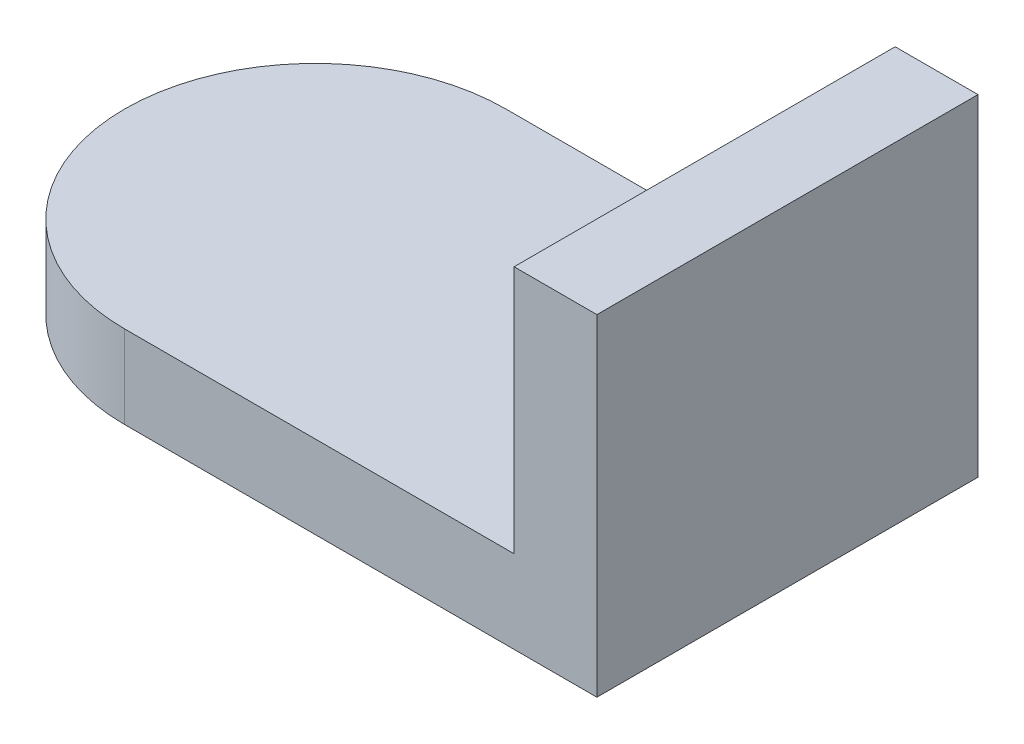
ISO-10303-21;
HEADER;
FILE_DESCRIPTION(('STEP AP214'),'2;1');
FILE_NAME('part.step','',(''),(''),'','','');
FILE_SCHEMA(('AUTOMOTIVE_DESIGN { 1 0 10303 214 1 1 1 1 }'));
ENDSEC;
DATA;
#1=APPLICATION_CONTEXT('core data for automotive mechanical design processes');
#2=APPLICATION_PROTOCOL_DEFINITION('international standard','automotive_design',2000,#1);
#3=PRODUCT_CONTEXT('',#1,'mechanical');
#4=PRODUCT('Part','Part','',(#3));
#5=PRODUCT_RELATED_PRODUCT_CATEGORY('part','',(#4));
#6=PRODUCT_DEFINITION_FORMATION('','',#4);
#7=PRODUCT_DEFINITION_CONTEXT('part definition',#1,'design');
#8=PRODUCT_DEFINITION('design','',#6,#7);
#9=PRODUCT_DEFINITION_SHAPE('','',#8);
#10=(LENGTH_UNIT() NAMED_UNIT(*) SI_UNIT(.MILLI.,.METRE.));
#11=(NAMED_UNIT(*) PLANE_ANGLE_UNIT() SI_UNIT($,.RADIAN.));
#12=(NAMED_UNIT(*) SI_UNIT($,.STERADIAN.) SOLID_ANGLE_UNIT());
#13=UNCERTAINTY_MEASURE_WITH_UNIT(LENGTH_MEASURE(1.E-05),#10,'distance_accuracy_value','');
#14=(GEOMETRIC_REPRESENTATION_CONTEXT(3) GLOBAL_UNCERTAINTY_ASSIGNED_CONTEXT((#13)) GLOBAL_UNIT_ASSIGNED_CONTEXT((#10,
#11,#12)) REPRESENTATION_CONTEXT('',''));
#15=CARTESIAN_POINT('',(0.,0.,0.));
#16=DIRECTION('',(0.,0.,1.));
#17=DIRECTION('',(1.,0.,0.));
#18=AXIS2_PLACEMENT_3D('',#15,#16,#17);
#19=CARTESIAN_POINT('',(1.45,-0.2,0.135));
#20=DIRECTION('',(0.,0.,-1.));
#21=DIRECTION('',(1.,0.,0.));
#22=AXIS2_PLACEMENT_3D('',#19,#20,#21);
#23=PLANE('',#22);
#24=DIRECTION('',(0.,-1.,0.));
#25=VECTOR('',#24,1.);
#26=CARTESIAN_POINT('',(1.5,-0.2,0.135));
#27=LINE('',#26,#25);
#28=CARTESIAN_POINT('',(1.5,-0.2,0.135));
#29=VERTEX_POINT('',#28);
#30=CARTESIAN_POINT('',(1.5,-0.4,0.135));
#31=VERTEX_POINT('',#30);
#32=EDGE_CURVE('E11',#29,#31,#27,.T.);
#33=ORIENTED_EDGE('',*,*,#32,.T.);
#34=DIRECTION('',(1.,0.,0.));
#35=VECTOR('',#34,1.);
#36=CARTESIAN_POINT('',(1.45,-0.4,0.135));
#37=LINE('',#36,#35);
#38=CARTESIAN_POINT('',(1.215,-0.4,0.135));
#39=VERTEX_POINT('',#38);
#40=EDGE_CURVE('E24',#39,#31,#37,.T.);
#41=ORIENTED_EDGE('',*,*,#40,.F.);
#42=DIRECTION('',(0.,-1.,0.));
#43=VECTOR('',#42,1.);
#44=CARTESIAN_POINT('',(1.215,-0.35,0.135));
#45=LINE('',#44,#43);
#46=CARTESIAN_POINT('',(1.215,-0.35,0.135));
#47=VERTEX_POINT('',#46);
#48=EDGE_CURVE('E86',#47,#39,#45,.T.);
#49=ORIENTED_EDGE('',*,*,#48,.F.);
#50=DIRECTION('',(-1.,0.,0.));
#51=VECTOR('',#50,1.);
#52=CARTESIAN_POINT('',(1.45,-0.35,0.135));
#53=LINE('',#52,#51);
#54=CARTESIAN_POINT('',(1.45,-0.35,0.135));
#55=VERTEX_POINT('',#54);
#56=EDGE_CURVE('E115',#55,#47,#53,.T.);
#57=ORIENTED_EDGE('',*,*,#56,.F.);
#58=DIRECTION('',(0.,-1.,0.));
#59=VECTOR('',#58,1.);
#60=CARTESIAN_POINT('',(1.45,-0.2,0.135));
#61=LINE('',#60,#59);
#62=CARTESIAN_POINT('',(1.45,-0.2,0.135));
#63=VERTEX_POINT('',#62);
#64=EDGE_CURVE('E112',#63,#55,#61,.T.);
#65=ORIENTED_EDGE('',*,*,#64,.F.);
#66=DIRECTION('',(1.,0.,0.));
#67=VECTOR('',#66,1.);
#68=CARTESIAN_POINT('',(1.45,-0.2,0.135));
#69=LINE('',#68,#67);
#70=EDGE_CURVE('E110',#63,#29,#69,.T.);
#71=ORIENTED_EDGE('',*,*,#70,.T.);
#72=EDGE_LOOP('',(#33,#41,#49,#57,#65,#71));
#73=FACE_BOUND('',#72,.T.);
#74=ADVANCED_FACE('F17',(#73),#23,.T.);
#75=CARTESIAN_POINT('',(1.45,-0.2,0.135));
#76=DIRECTION('',(0.,1.,0.));
#77=DIRECTION('',(0.,0.,1.));
#78=AXIS2_PLACEMENT_3D('',#75,#76,#77);
#79=PLANE('',#78);
#80=DIRECTION('',(0.,0.,-1.));
#81=VECTOR('',#80,1.);
#82=CARTESIAN_POINT('',(1.5,-0.2,0.135));
#83=LINE('',#82,#81);
#84=CARTESIAN_POINT('',(1.5,-0.2,0.365));
#85=VERTEX_POINT('',#84);
#86=EDGE_CURVE('E107',#85,#29,#83,.T.);
#87=ORIENTED_EDGE('',*,*,#86,.T.);
#88=ORIENTED_EDGE('',*,*,#70,.F.);
#89=DIRECTION('',(0.,0.,-1.));
#90=VECTOR('',#89,1.);
#91=CARTESIAN_POINT('',(1.45,-0.2,0.135));
#92=LINE('',#91,#90);
#93=CARTESIAN_POINT('',(1.45,-0.2,0.365));
#94=VERTEX_POINT('',#93);
#95=EDGE_CURVE('E104',#94,#63,#92,.T.);
#96=ORIENTED_EDGE('',*,*,#95,.F.);
#97=DIRECTION('',(1.,0.,0.));
#98=VECTOR('',#97,1.);
#99=CARTESIAN_POINT('',(1.45,-0.2,0.365));
#100=LINE('',#99,#98);
#101=EDGE_CURVE('E101',#94,#85,#100,.T.);
#102=ORIENTED_EDGE('',*,*,#101,.T.);
#103=EDGE_LOOP('',(#87,#88,#96,#102));
#104=FACE_BOUND('',#103,.T.);
#105=ADVANCED_FACE('F127',(#104),#79,.T.);
#106=CARTESIAN_POINT('',(1.45,-0.2,0.365));
#107=DIRECTION('',(0.,0.,1.));
#108=DIRECTION('',(0.,-1.,0.));
#109=AXIS2_PLACEMENT_3D('',#106,#107,#108);
#110=PLANE('',#109);
#111=DIRECTION('',(0.,1.,0.));
#112=VECTOR('',#111,1.);
#113=CARTESIAN_POINT('',(1.5,-0.2,0.365));
#114=LINE('',#113,#112);
#115=CARTESIAN_POINT('',(1.5,-0.4,0.365000000000001));
#116=VERTEX_POINT('',#115);
#117=EDGE_CURVE('E99',#116,#85,#114,.T.);
#118=ORIENTED_EDGE('',*,*,#117,.T.);
#119=ORIENTED_EDGE('',*,*,#101,.F.);
#120=DIRECTION('',(0.,1.,0.));
#121=VECTOR('',#120,1.);
#122=CARTESIAN_POINT('',(1.45,-0.2,0.365));
#123=LINE('',#122,#121);
#124=CARTESIAN_POINT('',(1.45,-0.35,0.365000000000001));
#125=VERTEX_POINT('',#124);
#126=EDGE_CURVE('E96',#125,#94,#123,.T.);
#127=ORIENTED_EDGE('',*,*,#126,.F.);
#128=DIRECTION('',(1.,0.,0.));
#129=VECTOR('',#128,1.);
#130=CARTESIAN_POINT('',(1.45,-0.35,0.365000000000001));
#131=LINE('',#130,#129);
#132=CARTESIAN_POINT('',(1.215,-0.35,0.365000000000001));
#133=VERTEX_POINT('',#132);
#134=EDGE_CURVE('E72',#133,#125,#131,.T.);
#135=ORIENTED_EDGE('',*,*,#134,.F.);
#136=DIRECTION('',(0.,-1.,0.));
#137=VECTOR('',#136,1.);
#138=CARTESIAN_POINT('',(1.215,-0.35,0.365000000000001));
#139=LINE('',#138,#137);
#140=CARTESIAN_POINT('',(1.215,-0.4,0.365000000000001));
#141=VERTEX_POINT('',#140);
#142=EDGE_CURVE('E65',#133,#141,#139,.T.);
#143=ORIENTED_EDGE('',*,*,#142,.T.);
#144=DIRECTION('',(1.,0.,0.));
#145=VECTOR('',#144,1.);
#146=CARTESIAN_POINT('',(1.45,-0.4,0.365000000000001));
#147=LINE('',#146,#145);
#148=EDGE_CURVE('E69',#141,#116,#147,.T.);
#149=ORIENTED_EDGE('',*,*,#148,.T.);
#150=EDGE_LOOP('',(#118,#119,#127,#135,#143,#149));
#151=FACE_BOUND('',#150,.T.);
#152=ADVANCED_FACE('F68',(#151),#110,.T.);
#153=CARTESIAN_POINT('',(1.45,-0.4,0.135));
#154=DIRECTION('',(0.,-1.,0.));
#155=DIRECTION('',(0.,0.,-1.));
#156=AXIS2_PLACEMENT_3D('',#153,#154,#155);
#157=PLANE('',#156);
#158=DIRECTION('',(0.,0.,1.));
#159=VECTOR('',#158,1.);
#160=CARTESIAN_POINT('',(1.5,-0.4,0.135));
#161=LINE('',#160,#159);
#162=EDGE_CURVE('E82',#31,#116,#161,.T.);
#163=ORIENTED_EDGE('',*,*,#162,.T.);
#164=ORIENTED_EDGE('',*,*,#148,.F.);
#165=CARTESIAN_POINT('',(1.215,-0.4,0.250000000000001));
#166=DIRECTION('',(0.,1.,0.));
#167=DIRECTION('',(0.,0.,1.));
#168=AXIS2_PLACEMENT_3D('',#165,#166,#167);
#169=CIRCLE('',#168,0.115);
#170=EDGE_CURVE('E81',#39,#141,#169,.T.);
#171=ORIENTED_EDGE('',*,*,#170,.F.);
#172=ORIENTED_EDGE('',*,*,#40,.T.);
#173=EDGE_LOOP('',(#163,#164,#171,#172));
#174=FACE_BOUND('',#173,.T.);
#175=ADVANCED_FACE('F80',(#174),#157,.T.);
#176=CARTESIAN_POINT('',(1.45,0.,0.));
#177=DIRECTION('',(1.,0.,0.));
#178=DIRECTION('',(0.,0.,1.));
#179=AXIS2_PLACEMENT_3D('',#176,#177,#178);
#180=PLANE('',#179);
#181=ORIENTED_EDGE('',*,*,#126,.T.);
#182=ORIENTED_EDGE('',*,*,#95,.T.);
#183=ORIENTED_EDGE('',*,*,#64,.T.);
#184=DIRECTION('',(0.,0.,-1.));
#185=VECTOR('',#184,1.);
#186=CARTESIAN_POINT('',(1.45,-0.35,0.135));
#187=LINE('',#186,#185);
#188=EDGE_CURVE('E87',#125,#55,#187,.T.);
#189=ORIENTED_EDGE('',*,*,#188,.F.);
#190=EDGE_LOOP('',(#181,#182,#183,#189));
#191=FACE_BOUND('',#190,.T.);
#192=ADVANCED_FACE('F123',(#191),#180,.F.);
#193=CARTESIAN_POINT('',(1.5,0.,0.));
#194=DIRECTION('',(1.,0.,0.));
#195=DIRECTION('',(0.,0.,1.));
#196=AXIS2_PLACEMENT_3D('',#193,#194,#195);
#197=PLANE('',#196);
#198=ORIENTED_EDGE('',*,*,#32,.F.);
#199=ORIENTED_EDGE('',*,*,#86,.F.);
#200=ORIENTED_EDGE('',*,*,#117,.F.);
#201=ORIENTED_EDGE('',*,*,#162,.F.);
#202=EDGE_LOOP('',(#198,#199,#200,#201));
#203=FACE_BOUND('',#202,.T.);
#204=ADVANCED_FACE('F118',(#203),#197,.T.);
#205=CARTESIAN_POINT('',(1.215,-0.35,0.250000000000001));
#206=DIRECTION('',(0.,-1.,0.));
#207=DIRECTION('',(0.,0.,-1.));
#208=AXIS2_PLACEMENT_3D('',#205,#206,#207);
#209=CYLINDRICAL_SURFACE('',#208,0.115);
#210=ORIENTED_EDGE('',*,*,#170,.T.);
#211=ORIENTED_EDGE('',*,*,#142,.F.);
#212=CARTESIAN_POINT('',(1.215,-0.35,0.250000000000001));
#213=DIRECTION('',(0.,1.,0.));
#214=DIRECTION('',(0.,0.,1.));
#215=AXIS2_PLACEMENT_3D('',#212,#213,#214);
#216=CIRCLE('',#215,0.115);
#217=EDGE_CURVE('E91',#47,#133,#216,.T.);
#218=ORIENTED_EDGE('',*,*,#217,.F.);
#219=ORIENTED_EDGE('',*,*,#48,.T.);
#220=EDGE_LOOP('',(#210,#211,#218,#219));
#221=FACE_BOUND('',#220,.T.);
#222=ADVANCED_FACE('F85',(#221),#209,.T.);
#223=CARTESIAN_POINT('',(1.215,-0.35,0.250000000000001));
#224=DIRECTION('',(0.,1.,0.));
#225=DIRECTION('',(0.,0.,1.));
#226=AXIS2_PLACEMENT_3D('',#223,#224,#225);
#227=PLANE('',#226);
#228=ORIENTED_EDGE('',*,*,#188,.T.);
#229=ORIENTED_EDGE('',*,*,#56,.T.);
#230=ORIENTED_EDGE('',*,*,#217,.T.);
#231=ORIENTED_EDGE('',*,*,#134,.T.);
#232=EDGE_LOOP('',(#228,#229,#230,#231));
#233=FACE_BOUND('',#232,.T.);
#234=ADVANCED_FACE('F125',(#233),#227,.T.);
#235=CLOSED_SHELL('',(#74,#105,#152,#175,#192,#204,#222,#234));
#236=MANIFOLD_SOLID_BREP('B1',#235);
#237=ADVANCED_BREP_SHAPE_REPRESENTATION('',(#18,#236),#14);
#238=SHAPE_DEFINITION_REPRESENTATION(#9,#237);
ENDSEC;
END-ISO-10303-21;
